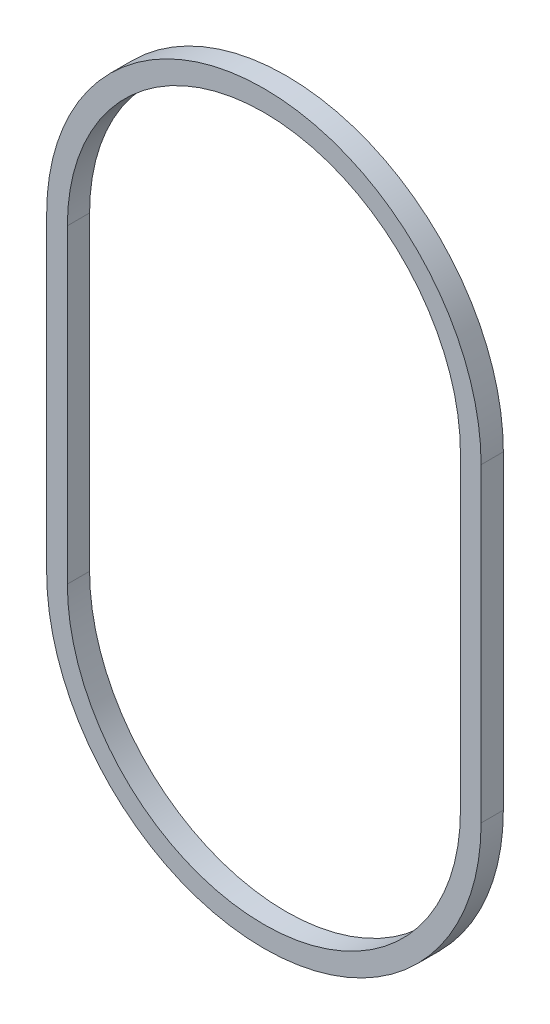
ISO-10303-21;
HEADER;
FILE_DESCRIPTION(('STEP AP214'),'2;1');
FILE_NAME('part.step','',(''),(''),'','','');
FILE_SCHEMA(('AUTOMOTIVE_DESIGN { 1 0 10303 214 1 1 1 1 }'));
ENDSEC;
DATA;
#1=APPLICATION_CONTEXT('core data for automotive mechanical design processes');
#2=APPLICATION_PROTOCOL_DEFINITION('international standard','automotive_design',2000,#1);
#3=PRODUCT_CONTEXT('',#1,'mechanical');
#4=PRODUCT('Part','Part','',(#3));
#5=PRODUCT_RELATED_PRODUCT_CATEGORY('part','',(#4));
#6=PRODUCT_DEFINITION_FORMATION('','',#4);
#7=PRODUCT_DEFINITION_CONTEXT('part definition',#1,'design');
#8=PRODUCT_DEFINITION('design','',#6,#7);
#9=PRODUCT_DEFINITION_SHAPE('','',#8);
#10=(LENGTH_UNIT() NAMED_UNIT(*) SI_UNIT(.MILLI.,.METRE.));
#11=(NAMED_UNIT(*) PLANE_ANGLE_UNIT() SI_UNIT($,.RADIAN.));
#12=(NAMED_UNIT(*) SI_UNIT($,.STERADIAN.) SOLID_ANGLE_UNIT());
#13=UNCERTAINTY_MEASURE_WITH_UNIT(LENGTH_MEASURE(1.E-05),#10,'distance_accuracy_value','');
#14=(GEOMETRIC_REPRESENTATION_CONTEXT(3) GLOBAL_UNCERTAINTY_ASSIGNED_CONTEXT((#13)) GLOBAL_UNIT_ASSIGNED_CONTEXT((#10,
#11,#12)) REPRESENTATION_CONTEXT('',''));
#15=CARTESIAN_POINT('',(0.,0.,0.));
#16=DIRECTION('',(0.,0.,1.));
#17=DIRECTION('',(1.,0.,0.));
#18=AXIS2_PLACEMENT_3D('',#15,#16,#17);
#19=CARTESIAN_POINT('',(0.,-15.,1.075));
#20=DIRECTION('',(0.,0.,1.));
#21=DIRECTION('',(1.,0.,0.));
#22=AXIS2_PLACEMENT_3D('',#19,#20,#21);
#23=PLANE('',#22);
#24=CARTESIAN_POINT('',(0.,-15.,1.075));
#25=DIRECTION('',(0.,0.,1.));
#26=DIRECTION('',(1.,0.,0.));
#27=AXIS2_PLACEMENT_3D('',#24,#25,#26);
#28=CIRCLE('',#27,21.);
#29=CARTESIAN_POINT('',(-21.,-15.,1.075));
#30=VERTEX_POINT('',#29);
#31=CARTESIAN_POINT('',(21.,-15.,1.075));
#32=VERTEX_POINT('',#31);
#33=EDGE_CURVE('E168',#30,#32,#28,.T.);
#34=ORIENTED_EDGE('',*,*,#33,.T.);
#35=DIRECTION('',(0.,1.,0.));
#36=VECTOR('',#35,1.);
#37=CARTESIAN_POINT('',(21.,-15.,1.075));
#38=LINE('',#37,#36);
#39=CARTESIAN_POINT('',(21.,15.,1.075));
#40=VERTEX_POINT('',#39);
#41=EDGE_CURVE('E171',#32,#40,#38,.T.);
#42=ORIENTED_EDGE('',*,*,#41,.T.);
#43=CARTESIAN_POINT('',(0.,15.,1.075));
#44=DIRECTION('',(0.,0.,1.));
#45=DIRECTION('',(1.,0.,0.));
#46=AXIS2_PLACEMENT_3D('',#43,#44,#45);
#47=CIRCLE('',#46,21.);
#48=CARTESIAN_POINT('',(-21.,15.,1.075));
#49=VERTEX_POINT('',#48);
#50=EDGE_CURVE('E174',#40,#49,#47,.T.);
#51=ORIENTED_EDGE('',*,*,#50,.T.);
#52=DIRECTION('',(0.,-1.,0.));
#53=VECTOR('',#52,1.);
#54=CARTESIAN_POINT('',(-21.,-15.,1.075));
#55=LINE('',#54,#53);
#56=EDGE_CURVE('E176',#49,#30,#55,.T.);
#57=ORIENTED_EDGE('',*,*,#56,.T.);
#58=EDGE_LOOP('',(#34,#42,#51,#57));
#59=FACE_BOUND('',#58,.T.);
#60=DIRECTION('',(0.,1.,0.));
#61=VECTOR('',#60,1.);
#62=CARTESIAN_POINT('',(19.,-15.,1.075));
#63=LINE('',#62,#61);
#64=CARTESIAN_POINT('',(19.,-15.,1.075));
#65=VERTEX_POINT('',#64);
#66=CARTESIAN_POINT('',(19.,15.,1.075));
#67=VERTEX_POINT('',#66);
#68=EDGE_CURVE('E140',#65,#67,#63,.T.);
#69=ORIENTED_EDGE('',*,*,#68,.F.);
#70=CARTESIAN_POINT('',(0.,-15.,1.075));
#71=DIRECTION('',(0.,0.,1.));
#72=DIRECTION('',(1.,0.,0.));
#73=AXIS2_PLACEMENT_3D('',#70,#71,#72);
#74=CIRCLE('',#73,19.);
#75=CARTESIAN_POINT('',(-19.,-15.,1.075));
#76=VERTEX_POINT('',#75);
#77=EDGE_CURVE('E132',#76,#65,#74,.T.);
#78=ORIENTED_EDGE('',*,*,#77,.F.);
#79=DIRECTION('',(0.,-1.,0.));
#80=VECTOR('',#79,1.);
#81=CARTESIAN_POINT('',(-19.,-15.,1.075));
#82=LINE('',#81,#80);
#83=CARTESIAN_POINT('',(-19.,15.,1.075));
#84=VERTEX_POINT('',#83);
#85=EDGE_CURVE('E154',#84,#76,#82,.T.);
#86=ORIENTED_EDGE('',*,*,#85,.F.);
#87=CARTESIAN_POINT('',(0.,15.,1.075));
#88=DIRECTION('',(0.,0.,1.));
#89=DIRECTION('',(1.,0.,0.));
#90=AXIS2_PLACEMENT_3D('',#87,#88,#89);
#91=CIRCLE('',#90,19.);
#92=EDGE_CURVE('E152',#67,#84,#91,.T.);
#93=ORIENTED_EDGE('',*,*,#92,.F.);
#94=EDGE_LOOP('',(#69,#78,#86,#93));
#95=FACE_BOUND('',#94,.T.);
#96=ADVANCED_FACE('F67',(#59,#95),#23,.T.);
#97=CARTESIAN_POINT('',(0.,-15.,-1.075));
#98=DIRECTION('',(0.,0.,1.));
#99=DIRECTION('',(1.,0.,0.));
#100=AXIS2_PLACEMENT_3D('',#97,#98,#99);
#101=PLANE('',#100);
#102=CARTESIAN_POINT('',(0.,-15.,-1.075));
#103=DIRECTION('',(0.,0.,1.));
#104=DIRECTION('',(1.,0.,0.));
#105=AXIS2_PLACEMENT_3D('',#102,#103,#104);
#106=CIRCLE('',#105,21.);
#107=CARTESIAN_POINT('',(-21.,-15.,-1.075));
#108=VERTEX_POINT('',#107);
#109=CARTESIAN_POINT('',(21.,-15.,-1.075));
#110=VERTEX_POINT('',#109);
#111=EDGE_CURVE('E148',#108,#110,#106,.T.);
#112=ORIENTED_EDGE('',*,*,#111,.F.);
#113=DIRECTION('',(0.,-1.,0.));
#114=VECTOR('',#113,1.);
#115=CARTESIAN_POINT('',(-21.,-15.,-1.075));
#116=LINE('',#115,#114);
#117=CARTESIAN_POINT('',(-21.,15.,-1.075));
#118=VERTEX_POINT('',#117);
#119=EDGE_CURVE('E172',#118,#108,#116,.T.);
#120=ORIENTED_EDGE('',*,*,#119,.F.);
#121=CARTESIAN_POINT('',(0.,15.,-1.075));
#122=DIRECTION('',(0.,0.,1.));
#123=DIRECTION('',(1.,0.,0.));
#124=AXIS2_PLACEMENT_3D('',#121,#122,#123);
#125=CIRCLE('',#124,21.);
#126=CARTESIAN_POINT('',(21.,15.,-1.075));
#127=VERTEX_POINT('',#126);
#128=EDGE_CURVE('E183',#127,#118,#125,.T.);
#129=ORIENTED_EDGE('',*,*,#128,.F.);
#130=DIRECTION('',(0.,1.,0.));
#131=VECTOR('',#130,1.);
#132=CARTESIAN_POINT('',(21.,-15.,-1.075));
#133=LINE('',#132,#131);
#134=EDGE_CURVE('E181',#110,#127,#133,.T.);
#135=ORIENTED_EDGE('',*,*,#134,.F.);
#136=EDGE_LOOP('',(#112,#120,#129,#135));
#137=FACE_BOUND('',#136,.T.);
#138=CARTESIAN_POINT('',(0.,-15.,-1.075));
#139=DIRECTION('',(0.,0.,1.));
#140=DIRECTION('',(1.,0.,0.));
#141=AXIS2_PLACEMENT_3D('',#138,#139,#140);
#142=CIRCLE('',#141,19.);
#143=CARTESIAN_POINT('',(-19.,-15.,-1.075));
#144=VERTEX_POINT('',#143);
#145=CARTESIAN_POINT('',(19.,-15.,-1.075));
#146=VERTEX_POINT('',#145);
#147=EDGE_CURVE('E90',#144,#146,#142,.T.);
#148=ORIENTED_EDGE('',*,*,#147,.T.);
#149=DIRECTION('',(0.,1.,0.));
#150=VECTOR('',#149,1.);
#151=CARTESIAN_POINT('',(19.,-15.,-1.075));
#152=LINE('',#151,#150);
#153=CARTESIAN_POINT('',(19.,15.,-1.075));
#154=VERTEX_POINT('',#153);
#155=EDGE_CURVE('E147',#146,#154,#152,.T.);
#156=ORIENTED_EDGE('',*,*,#155,.T.);
#157=CARTESIAN_POINT('',(0.,15.,-1.075));
#158=DIRECTION('',(0.,0.,1.));
#159=DIRECTION('',(1.,0.,0.));
#160=AXIS2_PLACEMENT_3D('',#157,#158,#159);
#161=CIRCLE('',#160,19.);
#162=CARTESIAN_POINT('',(-19.,15.,-1.075));
#163=VERTEX_POINT('',#162);
#164=EDGE_CURVE('E160',#154,#163,#161,.T.);
#165=ORIENTED_EDGE('',*,*,#164,.T.);
#166=DIRECTION('',(0.,-1.,0.));
#167=VECTOR('',#166,1.);
#168=CARTESIAN_POINT('',(-19.,-15.,-1.075));
#169=LINE('',#168,#167);
#170=EDGE_CURVE('E141',#163,#144,#169,.T.);
#171=ORIENTED_EDGE('',*,*,#170,.T.);
#172=EDGE_LOOP('',(#148,#156,#165,#171));
#173=FACE_BOUND('',#172,.T.);
#174=ADVANCED_FACE('F201',(#137,#173),#101,.F.);
#175=CARTESIAN_POINT('',(0.,-15.,1.075));
#176=DIRECTION('',(0.,0.,-1.));
#177=DIRECTION('',(-1.,0.,0.));
#178=AXIS2_PLACEMENT_3D('',#175,#176,#177);
#179=CYLINDRICAL_SURFACE('',#178,21.);
#180=ORIENTED_EDGE('',*,*,#111,.T.);
#181=DIRECTION('',(0.,0.,-1.));
#182=VECTOR('',#181,1.);
#183=CARTESIAN_POINT('',(21.,-15.,1.075));
#184=LINE('',#183,#182);
#185=EDGE_CURVE('E12',#32,#110,#184,.T.);
#186=ORIENTED_EDGE('',*,*,#185,.F.);
#187=ORIENTED_EDGE('',*,*,#33,.F.);
#188=DIRECTION('',(0.,0.,-1.));
#189=VECTOR('',#188,1.);
#190=CARTESIAN_POINT('',(-21.,-15.,1.075));
#191=LINE('',#190,#189);
#192=EDGE_CURVE('E178',#30,#108,#191,.T.);
#193=ORIENTED_EDGE('',*,*,#192,.T.);
#194=EDGE_LOOP('',(#180,#186,#187,#193));
#195=FACE_BOUND('',#194,.T.);
#196=ADVANCED_FACE('F69',(#195),#179,.T.);
#197=CARTESIAN_POINT('',(21.,-15.,1.075));
#198=DIRECTION('',(-1.,0.,0.));
#199=DIRECTION('',(0.,-1.,0.));
#200=AXIS2_PLACEMENT_3D('',#197,#198,#199);
#201=PLANE('',#200);
#202=ORIENTED_EDGE('',*,*,#134,.T.);
#203=DIRECTION('',(0.,0.,-1.));
#204=VECTOR('',#203,1.);
#205=CARTESIAN_POINT('',(21.,15.,1.075));
#206=LINE('',#205,#204);
#207=EDGE_CURVE('E75',#40,#127,#206,.T.);
#208=ORIENTED_EDGE('',*,*,#207,.F.);
#209=ORIENTED_EDGE('',*,*,#41,.F.);
#210=ORIENTED_EDGE('',*,*,#185,.T.);
#211=EDGE_LOOP('',(#202,#208,#209,#210));
#212=FACE_BOUND('',#211,.T.);
#213=ADVANCED_FACE('F211',(#212),#201,.F.);
#214=CARTESIAN_POINT('',(0.,15.,1.075));
#215=DIRECTION('',(0.,0.,-1.));
#216=DIRECTION('',(-1.,0.,0.));
#217=AXIS2_PLACEMENT_3D('',#214,#215,#216);
#218=CYLINDRICAL_SURFACE('',#217,21.);
#219=ORIENTED_EDGE('',*,*,#128,.T.);
#220=DIRECTION('',(0.,0.,-1.));
#221=VECTOR('',#220,1.);
#222=CARTESIAN_POINT('',(-21.,15.,1.075));
#223=LINE('',#222,#221);
#224=EDGE_CURVE('E188',#49,#118,#223,.T.);
#225=ORIENTED_EDGE('',*,*,#224,.F.);
#226=ORIENTED_EDGE('',*,*,#50,.F.);
#227=ORIENTED_EDGE('',*,*,#207,.T.);
#228=EDGE_LOOP('',(#219,#225,#226,#227));
#229=FACE_BOUND('',#228,.T.);
#230=ADVANCED_FACE('F195',(#229),#218,.T.);
#231=CARTESIAN_POINT('',(-21.,-15.,1.075));
#232=DIRECTION('',(1.,0.,0.));
#233=DIRECTION('',(0.,1.,0.));
#234=AXIS2_PLACEMENT_3D('',#231,#232,#233);
#235=PLANE('',#234);
#236=ORIENTED_EDGE('',*,*,#119,.T.);
#237=ORIENTED_EDGE('',*,*,#192,.F.);
#238=ORIENTED_EDGE('',*,*,#56,.F.);
#239=ORIENTED_EDGE('',*,*,#224,.T.);
#240=EDGE_LOOP('',(#236,#237,#238,#239));
#241=FACE_BOUND('',#240,.T.);
#242=ADVANCED_FACE('F205',(#241),#235,.F.);
#243=CARTESIAN_POINT('',(0.,-15.,1.075));
#244=DIRECTION('',(0.,0.,-1.));
#245=DIRECTION('',(-1.,0.,0.));
#246=AXIS2_PLACEMENT_3D('',#243,#244,#245);
#247=CYLINDRICAL_SURFACE('',#246,19.);
#248=ORIENTED_EDGE('',*,*,#147,.F.);
#249=DIRECTION('',(0.,0.,-1.));
#250=VECTOR('',#249,1.);
#251=CARTESIAN_POINT('',(-19.,-15.,1.075));
#252=LINE('',#251,#250);
#253=EDGE_CURVE('E136',#76,#144,#252,.T.);
#254=ORIENTED_EDGE('',*,*,#253,.F.);
#255=ORIENTED_EDGE('',*,*,#77,.T.);
#256=DIRECTION('',(0.,0.,-1.));
#257=VECTOR('',#256,1.);
#258=CARTESIAN_POINT('',(19.,-15.,1.075));
#259=LINE('',#258,#257);
#260=EDGE_CURVE('E135',#65,#146,#259,.T.);
#261=ORIENTED_EDGE('',*,*,#260,.T.);
#262=EDGE_LOOP('',(#248,#254,#255,#261));
#263=FACE_BOUND('',#262,.T.);
#264=ADVANCED_FACE('F134',(#263),#247,.F.);
#265=CARTESIAN_POINT('',(19.,-15.,1.075));
#266=DIRECTION('',(-1.,0.,0.));
#267=DIRECTION('',(0.,-1.,0.));
#268=AXIS2_PLACEMENT_3D('',#265,#266,#267);
#269=PLANE('',#268);
#270=ORIENTED_EDGE('',*,*,#155,.F.);
#271=ORIENTED_EDGE('',*,*,#260,.F.);
#272=ORIENTED_EDGE('',*,*,#68,.T.);
#273=DIRECTION('',(0.,0.,-1.));
#274=VECTOR('',#273,1.);
#275=CARTESIAN_POINT('',(19.,15.,1.075));
#276=LINE('',#275,#274);
#277=EDGE_CURVE('E149',#67,#154,#276,.T.);
#278=ORIENTED_EDGE('',*,*,#277,.T.);
#279=EDGE_LOOP('',(#270,#271,#272,#278));
#280=FACE_BOUND('',#279,.T.);
#281=ADVANCED_FACE('F144',(#280),#269,.T.);
#282=CARTESIAN_POINT('',(0.,15.,1.075));
#283=DIRECTION('',(0.,0.,-1.));
#284=DIRECTION('',(-1.,0.,0.));
#285=AXIS2_PLACEMENT_3D('',#282,#283,#284);
#286=CYLINDRICAL_SURFACE('',#285,19.);
#287=ORIENTED_EDGE('',*,*,#164,.F.);
#288=ORIENTED_EDGE('',*,*,#277,.F.);
#289=ORIENTED_EDGE('',*,*,#92,.T.);
#290=DIRECTION('',(0.,0.,-1.));
#291=VECTOR('',#290,1.);
#292=CARTESIAN_POINT('',(-19.,15.,1.075));
#293=LINE('',#292,#291);
#294=EDGE_CURVE('E82',#84,#163,#293,.T.);
#295=ORIENTED_EDGE('',*,*,#294,.T.);
#296=EDGE_LOOP('',(#287,#288,#289,#295));
#297=FACE_BOUND('',#296,.T.);
#298=ADVANCED_FACE('F234',(#297),#286,.F.);
#299=CARTESIAN_POINT('',(-19.,-15.,1.075));
#300=DIRECTION('',(1.,0.,0.));
#301=DIRECTION('',(0.,1.,0.));
#302=AXIS2_PLACEMENT_3D('',#299,#300,#301);
#303=PLANE('',#302);
#304=ORIENTED_EDGE('',*,*,#170,.F.);
#305=ORIENTED_EDGE('',*,*,#294,.F.);
#306=ORIENTED_EDGE('',*,*,#85,.T.);
#307=ORIENTED_EDGE('',*,*,#253,.T.);
#308=EDGE_LOOP('',(#304,#305,#306,#307));
#309=FACE_BOUND('',#308,.T.);
#310=ADVANCED_FACE('F238',(#309),#303,.T.);
#311=CLOSED_SHELL('',(#96,#174,#196,#213,#230,#242,#264,#281,#298,#310));
#312=MANIFOLD_SOLID_BREP('B2',#311);
#313=ADVANCED_BREP_SHAPE_REPRESENTATION('',(#18,#312),#14);
#314=SHAPE_DEFINITION_REPRESENTATION(#9,#313);
ENDSEC;
END-ISO-10303-21;
